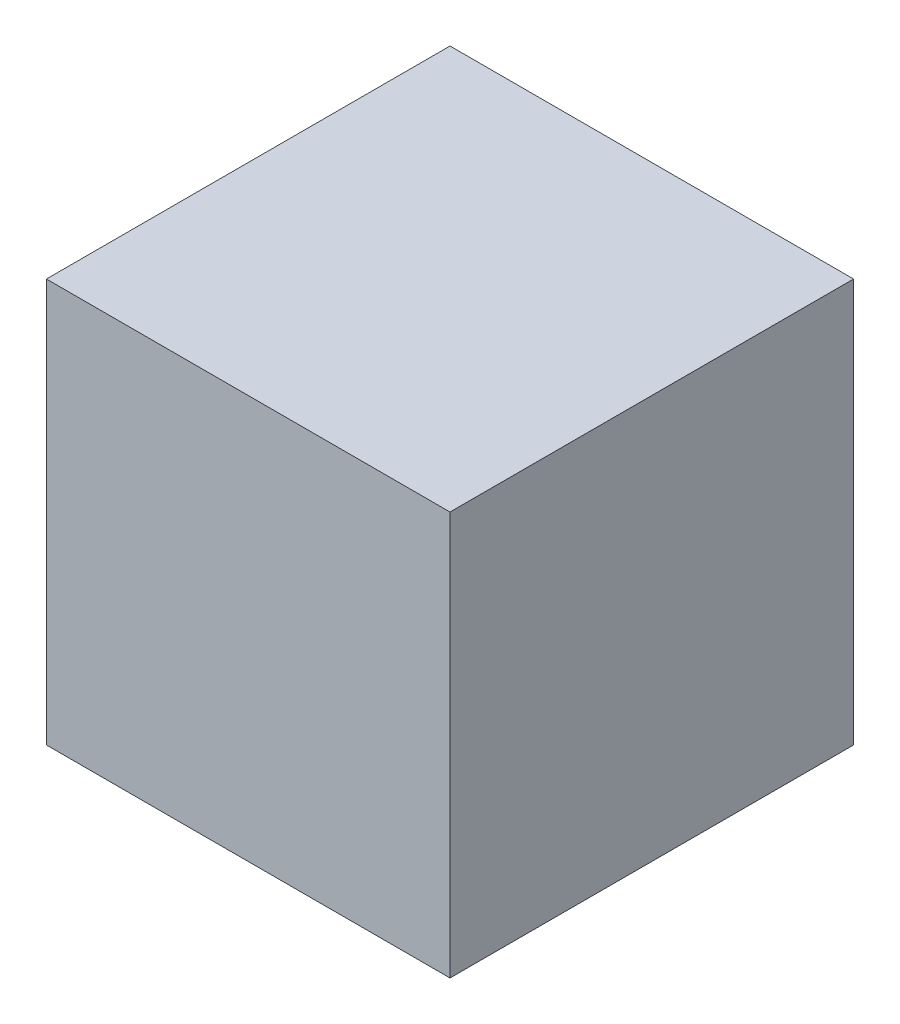
ISO-10303-21;
HEADER;
FILE_DESCRIPTION(('STEP AP214'),'2;1');
FILE_NAME('part.step','',(''),(''),'','','');
FILE_SCHEMA(('AUTOMOTIVE_DESIGN { 1 0 10303 214 1 1 1 1 }'));
ENDSEC;
DATA;
#1=APPLICATION_CONTEXT('core data for automotive mechanical design processes');
#2=APPLICATION_PROTOCOL_DEFINITION('international standard','automotive_design',2000,#1);
#3=PRODUCT_CONTEXT('',#1,'mechanical');
#4=PRODUCT('Part','Part','',(#3));
#5=PRODUCT_RELATED_PRODUCT_CATEGORY('part','',(#4));
#6=PRODUCT_DEFINITION_FORMATION('','',#4);
#7=PRODUCT_DEFINITION_CONTEXT('part definition',#1,'design');
#8=PRODUCT_DEFINITION('design','',#6,#7);
#9=PRODUCT_DEFINITION_SHAPE('','',#8);
#10=(LENGTH_UNIT() NAMED_UNIT(*) SI_UNIT(.MILLI.,.METRE.));
#11=(NAMED_UNIT(*) PLANE_ANGLE_UNIT() SI_UNIT($,.RADIAN.));
#12=(NAMED_UNIT(*) SI_UNIT($,.STERADIAN.) SOLID_ANGLE_UNIT());
#13=UNCERTAINTY_MEASURE_WITH_UNIT(LENGTH_MEASURE(1.E-05),#10,'distance_accuracy_value','');
#14=(GEOMETRIC_REPRESENTATION_CONTEXT(3) GLOBAL_UNCERTAINTY_ASSIGNED_CONTEXT((#13)) GLOBAL_UNIT_ASSIGNED_CONTEXT((#10,
#11,#12)) REPRESENTATION_CONTEXT('',''));
#15=CARTESIAN_POINT('',(0.,0.,0.));
#16=DIRECTION('',(0.,0.,1.));
#17=DIRECTION('',(1.,0.,0.));
#18=AXIS2_PLACEMENT_3D('',#15,#16,#17);
#19=CARTESIAN_POINT('',(120.415,120.415,120.415));
#20=DIRECTION('',(-1.,0.,0.));
#21=DIRECTION('',(0.,-1.,0.));
#22=AXIS2_PLACEMENT_3D('',#19,#20,#21);
#23=PLANE('',#22);
#24=DIRECTION('',(0.,1.,0.));
#25=VECTOR('',#24,1.);
#26=CARTESIAN_POINT('',(120.415,120.415,-120.415));
#27=LINE('',#26,#25);
#28=CARTESIAN_POINT('',(120.415,-120.415,-120.415));
#29=VERTEX_POINT('',#28);
#30=CARTESIAN_POINT('',(120.415,120.415,-120.415));
#31=VERTEX_POINT('',#30);
#32=EDGE_CURVE('E107',#29,#31,#27,.T.);
#33=ORIENTED_EDGE('',*,*,#32,.T.);
#34=DIRECTION('',(0.,0.,-1.));
#35=VECTOR('',#34,1.);
#36=CARTESIAN_POINT('',(120.415,120.415,120.415));
#37=LINE('',#36,#35);
#38=CARTESIAN_POINT('',(120.415,120.415,120.415));
#39=VERTEX_POINT('',#38);
#40=EDGE_CURVE('E11',#39,#31,#37,.T.);
#41=ORIENTED_EDGE('',*,*,#40,.F.);
#42=DIRECTION('',(0.,1.,0.));
#43=VECTOR('',#42,1.);
#44=CARTESIAN_POINT('',(120.415,120.415,120.415));
#45=LINE('',#44,#43);
#46=CARTESIAN_POINT('',(120.415,-120.415,120.415));
#47=VERTEX_POINT('',#46);
#48=EDGE_CURVE('E91',#47,#39,#45,.T.);
#49=ORIENTED_EDGE('',*,*,#48,.F.);
#50=DIRECTION('',(0.,0.,-1.));
#51=VECTOR('',#50,1.);
#52=CARTESIAN_POINT('',(120.415,-120.415,120.415));
#53=LINE('',#52,#51);
#54=EDGE_CURVE('E103',#47,#29,#53,.T.);
#55=ORIENTED_EDGE('',*,*,#54,.T.);
#56=EDGE_LOOP('',(#33,#41,#49,#55));
#57=FACE_BOUND('',#56,.T.);
#58=ADVANCED_FACE('F39',(#57),#23,.F.);
#59=CARTESIAN_POINT('',(-120.415,120.415,120.415));
#60=DIRECTION('',(0.,-1.,0.));
#61=DIRECTION('',(0.,0.,-1.));
#62=AXIS2_PLACEMENT_3D('',#59,#60,#61);
#63=PLANE('',#62);
#64=DIRECTION('',(-1.,0.,0.));
#65=VECTOR('',#64,1.);
#66=CARTESIAN_POINT('',(-120.415,120.415,-120.415));
#67=LINE('',#66,#65);
#68=CARTESIAN_POINT('',(-120.415,120.415,-120.415));
#69=VERTEX_POINT('',#68);
#70=EDGE_CURVE('E96',#31,#69,#67,.T.);
#71=ORIENTED_EDGE('',*,*,#70,.T.);
#72=DIRECTION('',(0.,0.,-1.));
#73=VECTOR('',#72,1.);
#74=CARTESIAN_POINT('',(-120.415,120.415,120.415));
#75=LINE('',#74,#73);
#76=CARTESIAN_POINT('',(-120.415,120.415,120.415));
#77=VERTEX_POINT('',#76);
#78=EDGE_CURVE('E48',#77,#69,#75,.T.);
#79=ORIENTED_EDGE('',*,*,#78,.F.);
#80=DIRECTION('',(-1.,0.,0.));
#81=VECTOR('',#80,1.);
#82=CARTESIAN_POINT('',(-120.415,120.415,120.415));
#83=LINE('',#82,#81);
#84=EDGE_CURVE('E86',#39,#77,#83,.T.);
#85=ORIENTED_EDGE('',*,*,#84,.F.);
#86=ORIENTED_EDGE('',*,*,#40,.T.);
#87=EDGE_LOOP('',(#71,#79,#85,#86));
#88=FACE_BOUND('',#87,.T.);
#89=ADVANCED_FACE('F95',(#88),#63,.F.);
#90=CARTESIAN_POINT('',(-120.415,120.415,120.415));
#91=DIRECTION('',(1.,0.,0.));
#92=DIRECTION('',(0.,1.,0.));
#93=AXIS2_PLACEMENT_3D('',#90,#91,#92);
#94=PLANE('',#93);
#95=DIRECTION('',(0.,-1.,0.));
#96=VECTOR('',#95,1.);
#97=CARTESIAN_POINT('',(-120.415,120.415,-120.415));
#98=LINE('',#97,#96);
#99=CARTESIAN_POINT('',(-120.415,-120.415,-120.415));
#100=VERTEX_POINT('',#99);
#101=EDGE_CURVE('E73',#69,#100,#98,.T.);
#102=ORIENTED_EDGE('',*,*,#101,.T.);
#103=DIRECTION('',(0.,0.,-1.));
#104=VECTOR('',#103,1.);
#105=CARTESIAN_POINT('',(-120.415,-120.415,120.415));
#106=LINE('',#105,#104);
#107=CARTESIAN_POINT('',(-120.415,-120.415,120.415));
#108=VERTEX_POINT('',#107);
#109=EDGE_CURVE('E98',#108,#100,#106,.T.);
#110=ORIENTED_EDGE('',*,*,#109,.F.);
#111=DIRECTION('',(0.,-1.,0.));
#112=VECTOR('',#111,1.);
#113=CARTESIAN_POINT('',(-120.415,120.415,120.415));
#114=LINE('',#113,#112);
#115=EDGE_CURVE('E89',#77,#108,#114,.T.);
#116=ORIENTED_EDGE('',*,*,#115,.F.);
#117=ORIENTED_EDGE('',*,*,#78,.T.);
#118=EDGE_LOOP('',(#102,#110,#116,#117));
#119=FACE_BOUND('',#118,.T.);
#120=ADVANCED_FACE('F99',(#119),#94,.F.);
#121=CARTESIAN_POINT('',(-120.415,-120.415,120.415));
#122=DIRECTION('',(0.,1.,0.));
#123=DIRECTION('',(0.,0.,1.));
#124=AXIS2_PLACEMENT_3D('',#121,#122,#123);
#125=PLANE('',#124);
#126=DIRECTION('',(1.,0.,0.));
#127=VECTOR('',#126,1.);
#128=CARTESIAN_POINT('',(-120.415,-120.415,-120.415));
#129=LINE('',#128,#127);
#130=EDGE_CURVE('E79',#100,#29,#129,.T.);
#131=ORIENTED_EDGE('',*,*,#130,.T.);
#132=ORIENTED_EDGE('',*,*,#54,.F.);
#133=DIRECTION('',(1.,0.,0.));
#134=VECTOR('',#133,1.);
#135=CARTESIAN_POINT('',(-120.415,-120.415,120.415));
#136=LINE('',#135,#134);
#137=EDGE_CURVE('E56',#108,#47,#136,.T.);
#138=ORIENTED_EDGE('',*,*,#137,.F.);
#139=ORIENTED_EDGE('',*,*,#109,.T.);
#140=EDGE_LOOP('',(#131,#132,#138,#139));
#141=FACE_BOUND('',#140,.T.);
#142=ADVANCED_FACE('F120',(#141),#125,.F.);
#143=CARTESIAN_POINT('',(0.,0.,120.415));
#144=DIRECTION('',(0.,0.,1.));
#145=DIRECTION('',(1.,0.,0.));
#146=AXIS2_PLACEMENT_3D('',#143,#144,#145);
#147=PLANE('',#146);
#148=ORIENTED_EDGE('',*,*,#48,.T.);
#149=ORIENTED_EDGE('',*,*,#84,.T.);
#150=ORIENTED_EDGE('',*,*,#115,.T.);
#151=ORIENTED_EDGE('',*,*,#137,.T.);
#152=EDGE_LOOP('',(#148,#149,#150,#151));
#153=FACE_BOUND('',#152,.T.);
#154=ADVANCED_FACE('F87',(#153),#147,.T.);
#155=CARTESIAN_POINT('',(0.,0.,-120.415));
#156=DIRECTION('',(0.,0.,1.));
#157=DIRECTION('',(1.,0.,0.));
#158=AXIS2_PLACEMENT_3D('',#155,#156,#157);
#159=PLANE('',#158);
#160=ORIENTED_EDGE('',*,*,#32,.F.);
#161=ORIENTED_EDGE('',*,*,#130,.F.);
#162=ORIENTED_EDGE('',*,*,#101,.F.);
#163=ORIENTED_EDGE('',*,*,#70,.F.);
#164=EDGE_LOOP('',(#160,#161,#162,#163));
#165=FACE_BOUND('',#164,.T.);
#166=ADVANCED_FACE('F123',(#165),#159,.F.);
#167=CLOSED_SHELL('',(#58,#89,#120,#142,#154,#166));
#168=MANIFOLD_SOLID_BREP('B2',#167);
#169=ADVANCED_BREP_SHAPE_REPRESENTATION('',(#18,#168),#14);
#170=SHAPE_DEFINITION_REPRESENTATION(#9,#169);
ENDSEC;
END-ISO-10303-21;
